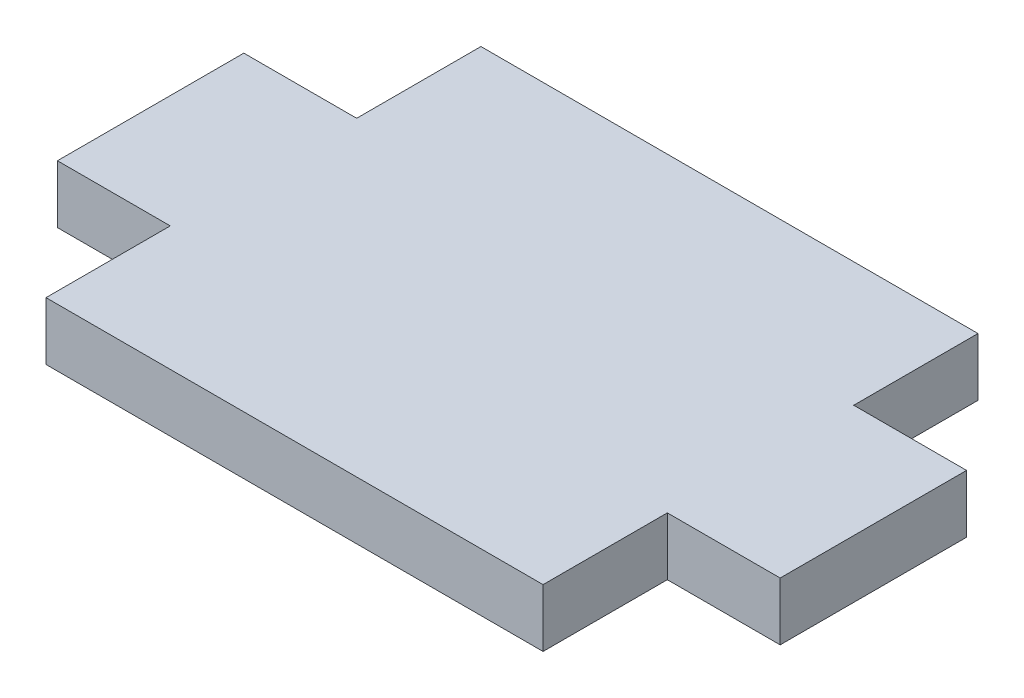
ISO-10303-21;
HEADER;
FILE_DESCRIPTION(('STEP AP214'),'2;1');
FILE_NAME('part.step','',(''),(''),'','','');
FILE_SCHEMA(('AUTOMOTIVE_DESIGN { 1 0 10303 214 1 1 1 1 }'));
ENDSEC;
DATA;
#1=APPLICATION_CONTEXT('core data for automotive mechanical design processes');
#2=APPLICATION_PROTOCOL_DEFINITION('international standard','automotive_design',2000,#1);
#3=PRODUCT_CONTEXT('',#1,'mechanical');
#4=PRODUCT('Part','Part','',(#3));
#5=PRODUCT_RELATED_PRODUCT_CATEGORY('part','',(#4));
#6=PRODUCT_DEFINITION_FORMATION('','',#4);
#7=PRODUCT_DEFINITION_CONTEXT('part definition',#1,'design');
#8=PRODUCT_DEFINITION('design','',#6,#7);
#9=PRODUCT_DEFINITION_SHAPE('','',#8);
#10=(LENGTH_UNIT() NAMED_UNIT(*) SI_UNIT(.MILLI.,.METRE.));
#11=(NAMED_UNIT(*) PLANE_ANGLE_UNIT() SI_UNIT($,.RADIAN.));
#12=(NAMED_UNIT(*) SI_UNIT($,.STERADIAN.) SOLID_ANGLE_UNIT());
#13=UNCERTAINTY_MEASURE_WITH_UNIT(LENGTH_MEASURE(1.E-05),#10,'distance_accuracy_value','');
#14=(GEOMETRIC_REPRESENTATION_CONTEXT(3) GLOBAL_UNCERTAINTY_ASSIGNED_CONTEXT((#13)) GLOBAL_UNIT_ASSIGNED_CONTEXT((#10,
#11,#12)) REPRESENTATION_CONTEXT('',''));
#15=CARTESIAN_POINT('',(0.,0.,0.));
#16=DIRECTION('',(0.,0.,1.));
#17=DIRECTION('',(1.,0.,0.));
#18=AXIS2_PLACEMENT_3D('',#15,#16,#17);
#19=CARTESIAN_POINT('',(12.7,2.9591,4.7625));
#20=DIRECTION('',(-1.,0.,0.));
#21=DIRECTION('',(0.,0.,1.));
#22=AXIS2_PLACEMENT_3D('',#19,#20,#21);
#23=PLANE('',#22);
#24=DIRECTION('',(0.,0.,-1.));
#25=VECTOR('',#24,1.);
#26=CARTESIAN_POINT('',(12.7,0.,4.7625));
#27=LINE('',#26,#25);
#28=CARTESIAN_POINT('',(12.7,0.,11.1125));
#29=VERTEX_POINT('',#28);
#30=CARTESIAN_POINT('',(12.7,0.,4.7625));
#31=VERTEX_POINT('',#30);
#32=EDGE_CURVE('E152',#29,#31,#27,.T.);
#33=ORIENTED_EDGE('',*,*,#32,.T.);
#34=DIRECTION('',(0.,-1.,0.));
#35=VECTOR('',#34,1.);
#36=CARTESIAN_POINT('',(12.7,2.9591,4.7625));
#37=LINE('',#36,#35);
#38=CARTESIAN_POINT('',(12.7,2.9591,4.7625));
#39=VERTEX_POINT('',#38);
#40=EDGE_CURVE('E11',#39,#31,#37,.T.);
#41=ORIENTED_EDGE('',*,*,#40,.F.);
#42=DIRECTION('',(0.,0.,-1.));
#43=VECTOR('',#42,1.);
#44=CARTESIAN_POINT('',(12.7,2.9591,4.7625));
#45=LINE('',#44,#43);
#46=CARTESIAN_POINT('',(12.7,2.9591,11.1125));
#47=VERTEX_POINT('',#46);
#48=EDGE_CURVE('E174',#47,#39,#45,.T.);
#49=ORIENTED_EDGE('',*,*,#48,.F.);
#50=DIRECTION('',(0.,-1.,0.));
#51=VECTOR('',#50,1.);
#52=CARTESIAN_POINT('',(12.7,2.9591,11.1125));
#53=LINE('',#52,#51);
#54=EDGE_CURVE('E148',#47,#29,#53,.T.);
#55=ORIENTED_EDGE('',*,*,#54,.T.);
#56=EDGE_LOOP('',(#33,#41,#49,#55));
#57=FACE_BOUND('',#56,.T.);
#58=ADVANCED_FACE('F32',(#57),#23,.F.);
#59=CARTESIAN_POINT('',(12.7,2.9591,4.7625));
#60=DIRECTION('',(0.,0.,-1.));
#61=DIRECTION('',(-1.,0.,0.));
#62=AXIS2_PLACEMENT_3D('',#59,#60,#61);
#63=PLANE('',#62);
#64=DIRECTION('',(1.,0.,0.));
#65=VECTOR('',#64,1.);
#66=CARTESIAN_POINT('',(12.7,0.,4.7625));
#67=LINE('',#66,#65);
#68=CARTESIAN_POINT('',(18.4658,0.,4.7625));
#69=VERTEX_POINT('',#68);
#70=EDGE_CURVE('E155',#31,#69,#67,.T.);
#71=ORIENTED_EDGE('',*,*,#70,.T.);
#72=DIRECTION('',(0.,-1.,0.));
#73=VECTOR('',#72,1.);
#74=CARTESIAN_POINT('',(18.4658,2.9591,4.7625));
#75=LINE('',#74,#73);
#76=CARTESIAN_POINT('',(18.4658,2.9591,4.7625));
#77=VERTEX_POINT('',#76);
#78=EDGE_CURVE('E40',#77,#69,#75,.T.);
#79=ORIENTED_EDGE('',*,*,#78,.F.);
#80=DIRECTION('',(1.,0.,0.));
#81=VECTOR('',#80,1.);
#82=CARTESIAN_POINT('',(12.7,2.9591,4.7625));
#83=LINE('',#82,#81);
#84=EDGE_CURVE('E103',#39,#77,#83,.T.);
#85=ORIENTED_EDGE('',*,*,#84,.F.);
#86=ORIENTED_EDGE('',*,*,#40,.T.);
#87=EDGE_LOOP('',(#71,#79,#85,#86));
#88=FACE_BOUND('',#87,.T.);
#89=ADVANCED_FACE('F252',(#88),#63,.F.);
#90=CARTESIAN_POINT('',(18.4658,2.9591,-4.7625));
#91=DIRECTION('',(-1.,0.,0.));
#92=DIRECTION('',(0.,0.,1.));
#93=AXIS2_PLACEMENT_3D('',#90,#91,#92);
#94=PLANE('',#93);
#95=DIRECTION('',(0.,0.,-1.));
#96=VECTOR('',#95,1.);
#97=CARTESIAN_POINT('',(18.4658,0.,-4.7625));
#98=LINE('',#97,#96);
#99=CARTESIAN_POINT('',(18.4658,0.,-4.7625));
#100=VERTEX_POINT('',#99);
#101=EDGE_CURVE('E157',#69,#100,#98,.T.);
#102=ORIENTED_EDGE('',*,*,#101,.T.);
#103=DIRECTION('',(0.,-1.,0.));
#104=VECTOR('',#103,1.);
#105=CARTESIAN_POINT('',(18.4658,2.9591,-4.7625));
#106=LINE('',#105,#104);
#107=CARTESIAN_POINT('',(18.4658,2.9591,-4.7625));
#108=VERTEX_POINT('',#107);
#109=EDGE_CURVE('E193',#108,#100,#106,.T.);
#110=ORIENTED_EDGE('',*,*,#109,.F.);
#111=DIRECTION('',(0.,0.,-1.));
#112=VECTOR('',#111,1.);
#113=CARTESIAN_POINT('',(18.4658,2.9591,-4.7625));
#114=LINE('',#113,#112);
#115=EDGE_CURVE('E201',#77,#108,#114,.T.);
#116=ORIENTED_EDGE('',*,*,#115,.F.);
#117=ORIENTED_EDGE('',*,*,#78,.T.);
#118=EDGE_LOOP('',(#102,#110,#116,#117));
#119=FACE_BOUND('',#118,.T.);
#120=ADVANCED_FACE('F199',(#119),#94,.F.);
#121=CARTESIAN_POINT('',(12.7,2.9591,-4.7625));
#122=DIRECTION('',(0.,0.,1.));
#123=DIRECTION('',(1.,0.,0.));
#124=AXIS2_PLACEMENT_3D('',#121,#122,#123);
#125=PLANE('',#124);
#126=DIRECTION('',(-1.,0.,0.));
#127=VECTOR('',#126,1.);
#128=CARTESIAN_POINT('',(12.7,0.,-4.7625));
#129=LINE('',#128,#127);
#130=CARTESIAN_POINT('',(12.7,0.,-4.7625));
#131=VERTEX_POINT('',#130);
#132=EDGE_CURVE('E159',#100,#131,#129,.T.);
#133=ORIENTED_EDGE('',*,*,#132,.T.);
#134=DIRECTION('',(0.,-1.,0.));
#135=VECTOR('',#134,1.);
#136=CARTESIAN_POINT('',(12.7,2.9591,-4.7625));
#137=LINE('',#136,#135);
#138=CARTESIAN_POINT('',(12.7,2.9591,-4.7625));
#139=VERTEX_POINT('',#138);
#140=EDGE_CURVE('E190',#139,#131,#137,.T.);
#141=ORIENTED_EDGE('',*,*,#140,.F.);
#142=DIRECTION('',(-1.,0.,0.));
#143=VECTOR('',#142,1.);
#144=CARTESIAN_POINT('',(12.7,2.9591,-4.7625));
#145=LINE('',#144,#143);
#146=EDGE_CURVE('E219',#108,#139,#145,.T.);
#147=ORIENTED_EDGE('',*,*,#146,.F.);
#148=ORIENTED_EDGE('',*,*,#109,.T.);
#149=EDGE_LOOP('',(#133,#141,#147,#148));
#150=FACE_BOUND('',#149,.T.);
#151=ADVANCED_FACE('F210',(#150),#125,.F.);
#152=CARTESIAN_POINT('',(12.7,2.9591,-11.1125));
#153=DIRECTION('',(-1.,0.,0.));
#154=DIRECTION('',(0.,0.,1.));
#155=AXIS2_PLACEMENT_3D('',#152,#153,#154);
#156=PLANE('',#155);
#157=DIRECTION('',(0.,0.,-1.));
#158=VECTOR('',#157,1.);
#159=CARTESIAN_POINT('',(12.7,0.,-11.1125));
#160=LINE('',#159,#158);
#161=CARTESIAN_POINT('',(12.7,0.,-11.1125));
#162=VERTEX_POINT('',#161);
#163=EDGE_CURVE('E161',#131,#162,#160,.T.);
#164=ORIENTED_EDGE('',*,*,#163,.T.);
#165=DIRECTION('',(0.,-1.,0.));
#166=VECTOR('',#165,1.);
#167=CARTESIAN_POINT('',(12.7,2.9591,-11.1125));
#168=LINE('',#167,#166);
#169=CARTESIAN_POINT('',(12.7,2.9591,-11.1125));
#170=VERTEX_POINT('',#169);
#171=EDGE_CURVE('E187',#170,#162,#168,.T.);
#172=ORIENTED_EDGE('',*,*,#171,.F.);
#173=DIRECTION('',(0.,0.,-1.));
#174=VECTOR('',#173,1.);
#175=CARTESIAN_POINT('',(12.7,2.9591,-11.1125));
#176=LINE('',#175,#174);
#177=EDGE_CURVE('E216',#139,#170,#176,.T.);
#178=ORIENTED_EDGE('',*,*,#177,.F.);
#179=ORIENTED_EDGE('',*,*,#140,.T.);
#180=EDGE_LOOP('',(#164,#172,#178,#179));
#181=FACE_BOUND('',#180,.T.);
#182=ADVANCED_FACE('F214',(#181),#156,.F.);
#183=CARTESIAN_POINT('',(-12.7,2.9591,-11.1125));
#184=DIRECTION('',(0.,0.,1.));
#185=DIRECTION('',(1.,0.,0.));
#186=AXIS2_PLACEMENT_3D('',#183,#184,#185);
#187=PLANE('',#186);
#188=DIRECTION('',(-1.,0.,0.));
#189=VECTOR('',#188,1.);
#190=CARTESIAN_POINT('',(-12.7,0.,-11.1125));
#191=LINE('',#190,#189);
#192=CARTESIAN_POINT('',(-12.7,0.,-11.1125));
#193=VERTEX_POINT('',#192);
#194=EDGE_CURVE('E163',#162,#193,#191,.T.);
#195=ORIENTED_EDGE('',*,*,#194,.T.);
#196=DIRECTION('',(0.,-1.,0.));
#197=VECTOR('',#196,1.);
#198=CARTESIAN_POINT('',(-12.7,2.9591,-11.1125));
#199=LINE('',#198,#197);
#200=CARTESIAN_POINT('',(-12.7,2.9591,-11.1125));
#201=VERTEX_POINT('',#200);
#202=EDGE_CURVE('E184',#201,#193,#199,.T.);
#203=ORIENTED_EDGE('',*,*,#202,.F.);
#204=DIRECTION('',(-1.,0.,0.));
#205=VECTOR('',#204,1.);
#206=CARTESIAN_POINT('',(-12.7,2.9591,-11.1125));
#207=LINE('',#206,#205);
#208=EDGE_CURVE('E218',#170,#201,#207,.T.);
#209=ORIENTED_EDGE('',*,*,#208,.F.);
#210=ORIENTED_EDGE('',*,*,#171,.T.);
#211=EDGE_LOOP('',(#195,#203,#209,#210));
#212=FACE_BOUND('',#211,.T.);
#213=ADVANCED_FACE('F265',(#212),#187,.F.);
#214=CARTESIAN_POINT('',(-12.7,2.9591,-11.1125));
#215=DIRECTION('',(1.,0.,0.));
#216=DIRECTION('',(0.,0.,-1.));
#217=AXIS2_PLACEMENT_3D('',#214,#215,#216);
#218=PLANE('',#217);
#219=DIRECTION('',(0.,0.,1.));
#220=VECTOR('',#219,1.);
#221=CARTESIAN_POINT('',(-12.7,0.,-11.1125));
#222=LINE('',#221,#220);
#223=CARTESIAN_POINT('',(-12.7,0.,-4.7625));
#224=VERTEX_POINT('',#223);
#225=EDGE_CURVE('E165',#193,#224,#222,.T.);
#226=ORIENTED_EDGE('',*,*,#225,.T.);
#227=DIRECTION('',(0.,-1.,0.));
#228=VECTOR('',#227,1.);
#229=CARTESIAN_POINT('',(-12.7,2.9591,-4.7625));
#230=LINE('',#229,#228);
#231=CARTESIAN_POINT('',(-12.7,2.9591,-4.7625));
#232=VERTEX_POINT('',#231);
#233=EDGE_CURVE('E181',#232,#224,#230,.T.);
#234=ORIENTED_EDGE('',*,*,#233,.F.);
#235=DIRECTION('',(0.,0.,1.));
#236=VECTOR('',#235,1.);
#237=CARTESIAN_POINT('',(-12.7,2.9591,-11.1125));
#238=LINE('',#237,#236);
#239=EDGE_CURVE('E221',#201,#232,#238,.T.);
#240=ORIENTED_EDGE('',*,*,#239,.F.);
#241=ORIENTED_EDGE('',*,*,#202,.T.);
#242=EDGE_LOOP('',(#226,#234,#240,#241));
#243=FACE_BOUND('',#242,.T.);
#244=ADVANCED_FACE('F268',(#243),#218,.F.);
#245=CARTESIAN_POINT('',(-12.7,2.9591,-4.7625));
#246=DIRECTION('',(0.,0.,1.));
#247=DIRECTION('',(1.,0.,0.));
#248=AXIS2_PLACEMENT_3D('',#245,#246,#247);
#249=PLANE('',#248);
#250=DIRECTION('',(-1.,0.,0.));
#251=VECTOR('',#250,1.);
#252=CARTESIAN_POINT('',(-12.7,0.,-4.7625));
#253=LINE('',#252,#251);
#254=CARTESIAN_POINT('',(-18.4658,0.,-4.7625));
#255=VERTEX_POINT('',#254);
#256=EDGE_CURVE('E167',#224,#255,#253,.T.);
#257=ORIENTED_EDGE('',*,*,#256,.T.);
#258=DIRECTION('',(0.,-1.,0.));
#259=VECTOR('',#258,1.);
#260=CARTESIAN_POINT('',(-18.4658,2.9591,-4.7625));
#261=LINE('',#260,#259);
#262=CARTESIAN_POINT('',(-18.4658,2.9591,-4.7625));
#263=VERTEX_POINT('',#262);
#264=EDGE_CURVE('E178',#263,#255,#261,.T.);
#265=ORIENTED_EDGE('',*,*,#264,.F.);
#266=DIRECTION('',(-1.,0.,0.));
#267=VECTOR('',#266,1.);
#268=CARTESIAN_POINT('',(-12.7,2.9591,-4.7625));
#269=LINE('',#268,#267);
#270=EDGE_CURVE('E227',#232,#263,#269,.T.);
#271=ORIENTED_EDGE('',*,*,#270,.F.);
#272=ORIENTED_EDGE('',*,*,#233,.T.);
#273=EDGE_LOOP('',(#257,#265,#271,#272));
#274=FACE_BOUND('',#273,.T.);
#275=ADVANCED_FACE('F233',(#274),#249,.F.);
#276=CARTESIAN_POINT('',(-18.4658,2.9591,-4.7625));
#277=DIRECTION('',(1.,0.,0.));
#278=DIRECTION('',(0.,0.,-1.));
#279=AXIS2_PLACEMENT_3D('',#276,#277,#278);
#280=PLANE('',#279);
#281=DIRECTION('',(0.,0.,1.));
#282=VECTOR('',#281,1.);
#283=CARTESIAN_POINT('',(-18.4658,0.,-4.7625));
#284=LINE('',#283,#282);
#285=CARTESIAN_POINT('',(-18.4658,0.,4.76249999999999));
#286=VERTEX_POINT('',#285);
#287=EDGE_CURVE('E169',#255,#286,#284,.T.);
#288=ORIENTED_EDGE('',*,*,#287,.T.);
#289=DIRECTION('',(0.,-1.,0.));
#290=VECTOR('',#289,1.);
#291=CARTESIAN_POINT('',(-18.4658,2.9591,4.76249999999999));
#292=LINE('',#291,#290);
#293=CARTESIAN_POINT('',(-18.4658,2.9591,4.76249999999999));
#294=VERTEX_POINT('',#293);
#295=EDGE_CURVE('E143',#294,#286,#292,.T.);
#296=ORIENTED_EDGE('',*,*,#295,.F.);
#297=DIRECTION('',(0.,0.,1.));
#298=VECTOR('',#297,1.);
#299=CARTESIAN_POINT('',(-18.4658,2.9591,-4.7625));
#300=LINE('',#299,#298);
#301=EDGE_CURVE('E134',#263,#294,#300,.T.);
#302=ORIENTED_EDGE('',*,*,#301,.F.);
#303=ORIENTED_EDGE('',*,*,#264,.T.);
#304=EDGE_LOOP('',(#288,#296,#302,#303));
#305=FACE_BOUND('',#304,.T.);
#306=ADVANCED_FACE('F237',(#305),#280,.F.);
#307=CARTESIAN_POINT('',(-12.7,2.9591,4.76249999999999));
#308=DIRECTION('',(0.,0.,-1.));
#309=DIRECTION('',(-1.,0.,0.));
#310=AXIS2_PLACEMENT_3D('',#307,#308,#309);
#311=PLANE('',#310);
#312=DIRECTION('',(1.,0.,0.));
#313=VECTOR('',#312,1.);
#314=CARTESIAN_POINT('',(-12.7,0.,4.76249999999999));
#315=LINE('',#314,#313);
#316=CARTESIAN_POINT('',(-12.7,0.,4.76249999999999));
#317=VERTEX_POINT('',#316);
#318=EDGE_CURVE('E142',#286,#317,#315,.T.);
#319=ORIENTED_EDGE('',*,*,#318,.T.);
#320=DIRECTION('',(0.,-1.,0.));
#321=VECTOR('',#320,1.);
#322=CARTESIAN_POINT('',(-12.7,2.9591,4.76249999999999));
#323=LINE('',#322,#321);
#324=CARTESIAN_POINT('',(-12.7,2.9591,4.76249999999999));
#325=VERTEX_POINT('',#324);
#326=EDGE_CURVE('E139',#325,#317,#323,.T.);
#327=ORIENTED_EDGE('',*,*,#326,.F.);
#328=DIRECTION('',(1.,0.,0.));
#329=VECTOR('',#328,1.);
#330=CARTESIAN_POINT('',(-12.7,2.9591,4.76249999999999));
#331=LINE('',#330,#329);
#332=EDGE_CURVE('E128',#294,#325,#331,.T.);
#333=ORIENTED_EDGE('',*,*,#332,.F.);
#334=ORIENTED_EDGE('',*,*,#295,.T.);
#335=EDGE_LOOP('',(#319,#327,#333,#334));
#336=FACE_BOUND('',#335,.T.);
#337=ADVANCED_FACE('F140',(#336),#311,.F.);
#338=CARTESIAN_POINT('',(-12.7,2.9591,4.76249999999999));
#339=DIRECTION('',(1.,0.,0.));
#340=DIRECTION('',(0.,0.,-1.));
#341=AXIS2_PLACEMENT_3D('',#338,#339,#340);
#342=PLANE('',#341);
#343=DIRECTION('',(0.,0.,1.));
#344=VECTOR('',#343,1.);
#345=CARTESIAN_POINT('',(-12.7,0.,4.76249999999999));
#346=LINE('',#345,#344);
#347=CARTESIAN_POINT('',(-12.7,0.,11.1125));
#348=VERTEX_POINT('',#347);
#349=EDGE_CURVE('E89',#317,#348,#346,.T.);
#350=ORIENTED_EDGE('',*,*,#349,.T.);
#351=DIRECTION('',(0.,-1.,0.));
#352=VECTOR('',#351,1.);
#353=CARTESIAN_POINT('',(-12.7,2.9591,11.1125));
#354=LINE('',#353,#352);
#355=CARTESIAN_POINT('',(-12.7,2.9591,11.1125));
#356=VERTEX_POINT('',#355);
#357=EDGE_CURVE('E144',#356,#348,#354,.T.);
#358=ORIENTED_EDGE('',*,*,#357,.F.);
#359=DIRECTION('',(0.,0.,1.));
#360=VECTOR('',#359,1.);
#361=CARTESIAN_POINT('',(-12.7,2.9591,4.76249999999999));
#362=LINE('',#361,#360);
#363=EDGE_CURVE('E132',#325,#356,#362,.T.);
#364=ORIENTED_EDGE('',*,*,#363,.F.);
#365=ORIENTED_EDGE('',*,*,#326,.T.);
#366=EDGE_LOOP('',(#350,#358,#364,#365));
#367=FACE_BOUND('',#366,.T.);
#368=ADVANCED_FACE('F146',(#367),#342,.F.);
#369=CARTESIAN_POINT('',(-12.7,2.9591,11.1125));
#370=DIRECTION('',(0.,0.,-1.));
#371=DIRECTION('',(-1.,0.,0.));
#372=AXIS2_PLACEMENT_3D('',#369,#370,#371);
#373=PLANE('',#372);
#374=DIRECTION('',(1.,0.,0.));
#375=VECTOR('',#374,1.);
#376=CARTESIAN_POINT('',(-12.7,0.,11.1125));
#377=LINE('',#376,#375);
#378=EDGE_CURVE('E95',#348,#29,#377,.T.);
#379=ORIENTED_EDGE('',*,*,#378,.T.);
#380=ORIENTED_EDGE('',*,*,#54,.F.);
#381=DIRECTION('',(1.,0.,0.));
#382=VECTOR('',#381,1.);
#383=CARTESIAN_POINT('',(-12.7,2.9591,11.1125));
#384=LINE('',#383,#382);
#385=EDGE_CURVE('E48',#356,#47,#384,.T.);
#386=ORIENTED_EDGE('',*,*,#385,.F.);
#387=ORIENTED_EDGE('',*,*,#357,.T.);
#388=EDGE_LOOP('',(#379,#380,#386,#387));
#389=FACE_BOUND('',#388,.T.);
#390=ADVANCED_FACE('F241',(#389),#373,.F.);
#391=CARTESIAN_POINT('',(0.,2.9591,0.));
#392=DIRECTION('',(0.,1.,0.));
#393=DIRECTION('',(0.,0.,1.));
#394=AXIS2_PLACEMENT_3D('',#391,#392,#393);
#395=PLANE('',#394);
#396=ORIENTED_EDGE('',*,*,#48,.T.);
#397=ORIENTED_EDGE('',*,*,#84,.T.);
#398=ORIENTED_EDGE('',*,*,#115,.T.);
#399=ORIENTED_EDGE('',*,*,#146,.T.);
#400=ORIENTED_EDGE('',*,*,#177,.T.);
#401=ORIENTED_EDGE('',*,*,#208,.T.);
#402=ORIENTED_EDGE('',*,*,#239,.T.);
#403=ORIENTED_EDGE('',*,*,#270,.T.);
#404=ORIENTED_EDGE('',*,*,#301,.T.);
#405=ORIENTED_EDGE('',*,*,#332,.T.);
#406=ORIENTED_EDGE('',*,*,#363,.T.);
#407=ORIENTED_EDGE('',*,*,#385,.T.);
#408=EDGE_LOOP('',(#396,#397,#398,#399,#400,#401,#402,#403,#404,#405,#406,#407));
#409=FACE_BOUND('',#408,.T.);
#410=ADVANCED_FACE('F130',(#409),#395,.T.);
#411=CARTESIAN_POINT('',(0.,0.,0.));
#412=DIRECTION('',(0.,1.,0.));
#413=DIRECTION('',(0.,0.,1.));
#414=AXIS2_PLACEMENT_3D('',#411,#412,#413);
#415=PLANE('',#414);
#416=ORIENTED_EDGE('',*,*,#32,.F.);
#417=ORIENTED_EDGE('',*,*,#378,.F.);
#418=ORIENTED_EDGE('',*,*,#349,.F.);
#419=ORIENTED_EDGE('',*,*,#318,.F.);
#420=ORIENTED_EDGE('',*,*,#287,.F.);
#421=ORIENTED_EDGE('',*,*,#256,.F.);
#422=ORIENTED_EDGE('',*,*,#225,.F.);
#423=ORIENTED_EDGE('',*,*,#194,.F.);
#424=ORIENTED_EDGE('',*,*,#163,.F.);
#425=ORIENTED_EDGE('',*,*,#132,.F.);
#426=ORIENTED_EDGE('',*,*,#101,.F.);
#427=ORIENTED_EDGE('',*,*,#70,.F.);
#428=EDGE_LOOP('',(#416,#417,#418,#419,#420,#421,#422,#423,#424,#425,#426,#427));
#429=FACE_BOUND('',#428,.T.);
#430=ADVANCED_FACE('F205',(#429),#415,.F.);
#431=CLOSED_SHELL('',(#58,#89,#120,#151,#182,#213,#244,#275,#306,#337,#368,#390,#410,#430));
#432=MANIFOLD_SOLID_BREP('B2',#431);
#433=ADVANCED_BREP_SHAPE_REPRESENTATION('',(#18,#432),#14);
#434=SHAPE_DEFINITION_REPRESENTATION(#9,#433);
ENDSEC;
END-ISO-10303-21;
